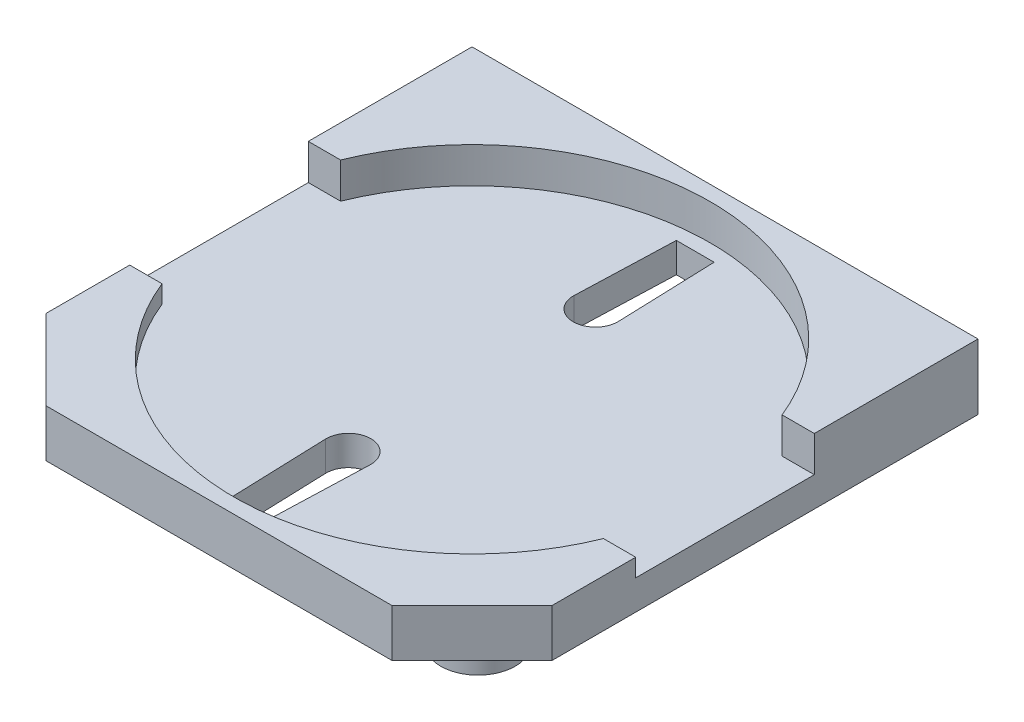
ISO-10303-21;
HEADER;
FILE_DESCRIPTION(('STEP AP214'),'2;1');
FILE_NAME('part.step','',(''),(''),'','','');
FILE_SCHEMA(('AUTOMOTIVE_DESIGN { 1 0 10303 214 1 1 1 1 }'));
ENDSEC;
DATA;
#1=APPLICATION_CONTEXT('core data for automotive mechanical design processes');
#2=APPLICATION_PROTOCOL_DEFINITION('international standard','automotive_design',2000,#1);
#3=PRODUCT_CONTEXT('',#1,'mechanical');
#4=PRODUCT('Part','Part','',(#3));
#5=PRODUCT_RELATED_PRODUCT_CATEGORY('part','',(#4));
#6=PRODUCT_DEFINITION_FORMATION('','',#4);
#7=PRODUCT_DEFINITION_CONTEXT('part definition',#1,'design');
#8=PRODUCT_DEFINITION('design','',#6,#7);
#9=PRODUCT_DEFINITION_SHAPE('','',#8);
#10=(LENGTH_UNIT() NAMED_UNIT(*) SI_UNIT(.MILLI.,.METRE.));
#11=(NAMED_UNIT(*) PLANE_ANGLE_UNIT() SI_UNIT($,.RADIAN.));
#12=(NAMED_UNIT(*) SI_UNIT($,.STERADIAN.) SOLID_ANGLE_UNIT());
#13=UNCERTAINTY_MEASURE_WITH_UNIT(LENGTH_MEASURE(1.E-05),#10,'distance_accuracy_value','');
#14=(GEOMETRIC_REPRESENTATION_CONTEXT(3) GLOBAL_UNCERTAINTY_ASSIGNED_CONTEXT((#13)) GLOBAL_UNIT_ASSIGNED_CONTEXT((#10,
#11,#12)) REPRESENTATION_CONTEXT('',''));
#15=CARTESIAN_POINT('',(0.,0.,0.));
#16=DIRECTION('',(0.,0.,1.));
#17=DIRECTION('',(1.,0.,0.));
#18=AXIS2_PLACEMENT_3D('',#15,#16,#17);
#19=CARTESIAN_POINT('',(-0.6,2.3,8.5));
#20=DIRECTION('',(0.999402445633192,0.,-0.0345651799126632));
#21=DIRECTION('',(-0.0345651799126632,0.,-0.999402445633192));
#22=AXIS2_PLACEMENT_3D('',#19,#20,#21);
#23=PLANE('',#22);
#24=DIRECTION('',(0.0345651799126632,0.,0.999402445633192));
#25=VECTOR('',#24,1.);
#26=CARTESIAN_POINT('',(-0.6,2.3,8.5));
#27=LINE('',#26,#25);
#28=CARTESIAN_POINT('',(-0.749551834224894,2.3,4.1759238849345));
#29=VERTEX_POINT('',#28);
#30=CARTESIAN_POINT('',(-0.63458584683647,2.3,7.5));
#31=VERTEX_POINT('',#30);
#32=EDGE_CURVE('E197',#29,#31,#27,.T.);
#33=ORIENTED_EDGE('',*,*,#32,.T.);
#34=DIRECTION('',(0.,-1.,0.));
#35=VECTOR('',#34,1.);
#36=CARTESIAN_POINT('',(-0.63458584683647,2.3,7.5));
#37=LINE('',#36,#35);
#38=CARTESIAN_POINT('',(-0.63458584683647,1.3,7.5));
#39=VERTEX_POINT('',#38);
#40=EDGE_CURVE('E202',#31,#39,#37,.T.);
#41=ORIENTED_EDGE('',*,*,#40,.T.);
#42=DIRECTION('',(0.0345651799126632,0.,0.999402445633192));
#43=VECTOR('',#42,1.);
#44=CARTESIAN_POINT('',(-0.6,1.3,8.5));
#45=LINE('',#44,#43);
#46=CARTESIAN_POINT('',(-0.749551834224894,1.3,4.1759238849345));
#47=VERTEX_POINT('',#46);
#48=EDGE_CURVE('E228',#47,#39,#45,.T.);
#49=ORIENTED_EDGE('',*,*,#48,.F.);
#50=DIRECTION('',(0.,-1.,0.));
#51=VECTOR('',#50,1.);
#52=CARTESIAN_POINT('',(-0.749551834224894,2.3,4.1759238849345));
#53=LINE('',#52,#51);
#54=EDGE_CURVE('E212',#29,#47,#53,.T.);
#55=ORIENTED_EDGE('',*,*,#54,.F.);
#56=EDGE_LOOP('',(#33,#41,#49,#55));
#57=FACE_BOUND('',#56,.T.);
#58=ADVANCED_FACE('F40',(#57),#23,.T.);
#59=CARTESIAN_POINT('',(0.6,2.3,8.5));
#60=DIRECTION('',(-0.999402445633192,0.,-0.0345651799126632));
#61=DIRECTION('',(-0.0345651799126632,0.,0.999402445633192));
#62=AXIS2_PLACEMENT_3D('',#59,#60,#61);
#63=PLANE('',#62);
#64=DIRECTION('',(0.0345651799126632,0.,-0.999402445633192));
#65=VECTOR('',#64,1.);
#66=CARTESIAN_POINT('',(0.6,1.3,8.5));
#67=LINE('',#66,#65);
#68=CARTESIAN_POINT('',(0.63458584683647,1.3,7.5));
#69=VERTEX_POINT('',#68);
#70=CARTESIAN_POINT('',(0.749551834224894,1.3,4.1759238849345));
#71=VERTEX_POINT('',#70);
#72=EDGE_CURVE('E215',#69,#71,#67,.T.);
#73=ORIENTED_EDGE('',*,*,#72,.F.);
#74=DIRECTION('',(0.,-1.,0.));
#75=VECTOR('',#74,1.);
#76=CARTESIAN_POINT('',(0.63458584683647,2.3,7.5));
#77=LINE('',#76,#75);
#78=CARTESIAN_POINT('',(0.63458584683647,2.3,7.5));
#79=VERTEX_POINT('',#78);
#80=EDGE_CURVE('E208',#79,#69,#77,.T.);
#81=ORIENTED_EDGE('',*,*,#80,.F.);
#82=DIRECTION('',(0.0345651799126632,0.,-0.999402445633192));
#83=VECTOR('',#82,1.);
#84=CARTESIAN_POINT('',(0.6,2.3,8.5));
#85=LINE('',#84,#83);
#86=CARTESIAN_POINT('',(0.749551834224894,2.3,4.1759238849345));
#87=VERTEX_POINT('',#86);
#88=EDGE_CURVE('E198',#79,#87,#85,.T.);
#89=ORIENTED_EDGE('',*,*,#88,.T.);
#90=DIRECTION('',(0.,-1.,0.));
#91=VECTOR('',#90,1.);
#92=CARTESIAN_POINT('',(0.749551834224894,2.3,4.1759238849345));
#93=LINE('',#92,#91);
#94=EDGE_CURVE('E234',#87,#71,#93,.T.);
#95=ORIENTED_EDGE('',*,*,#94,.T.);
#96=EDGE_LOOP('',(#73,#81,#89,#95));
#97=FACE_BOUND('',#96,.T.);
#98=ADVANCED_FACE('F510',(#97),#63,.T.);
#99=CARTESIAN_POINT('',(-8.5,3.5,8.5));
#100=DIRECTION('',(0.,0.,-1.));
#101=DIRECTION('',(-1.,0.,0.));
#102=AXIS2_PLACEMENT_3D('',#99,#100,#101);
#103=PLANE('',#102);
#104=DIRECTION('',(0.,1.,0.));
#105=VECTOR('',#104,1.);
#106=CARTESIAN_POINT('',(-5.81299423149112,0.,8.5));
#107=LINE('',#106,#105);
#108=CARTESIAN_POINT('',(-5.81299423149112,1.3,8.5));
#109=VERTEX_POINT('',#108);
#110=CARTESIAN_POINT('',(-5.81299423149112,2.9,8.5));
#111=VERTEX_POINT('',#110);
#112=EDGE_CURVE('E407',#109,#111,#107,.T.);
#113=ORIENTED_EDGE('',*,*,#112,.F.);
#114=DIRECTION('',(-1.,0.,0.));
#115=VECTOR('',#114,1.);
#116=CARTESIAN_POINT('',(-8.5,1.3,8.5));
#117=LINE('',#116,#115);
#118=CARTESIAN_POINT('',(5.81299423149112,1.3,8.5));
#119=VERTEX_POINT('',#118);
#120=EDGE_CURVE('E296',#119,#109,#117,.T.);
#121=ORIENTED_EDGE('',*,*,#120,.F.);
#122=DIRECTION('',(0.,1.,0.));
#123=VECTOR('',#122,1.);
#124=CARTESIAN_POINT('',(5.81299423149112,0.,8.5));
#125=LINE('',#124,#123);
#126=CARTESIAN_POINT('',(5.81299423149112,2.9,8.5));
#127=VERTEX_POINT('',#126);
#128=EDGE_CURVE('E404',#119,#127,#125,.T.);
#129=ORIENTED_EDGE('',*,*,#128,.T.);
#130=DIRECTION('',(1.,0.,0.));
#131=VECTOR('',#130,1.);
#132=CARTESIAN_POINT('',(5.81299423149112,2.9,8.5));
#133=LINE('',#132,#131);
#134=EDGE_CURVE('E381',#111,#127,#133,.T.);
#135=ORIENTED_EDGE('',*,*,#134,.F.);
#136=EDGE_LOOP('',(#113,#121,#129,#135));
#137=FACE_BOUND('',#136,.T.);
#138=ADVANCED_FACE('F451',(#137),#103,.F.);
#139=CARTESIAN_POINT('',(8.5,3.5,8.5));
#140=DIRECTION('',(-1.,0.,0.));
#141=DIRECTION('',(0.,0.,1.));
#142=AXIS2_PLACEMENT_3D('',#139,#140,#141);
#143=PLANE('',#142);
#144=DIRECTION('',(0.,0.,1.));
#145=VECTOR('',#144,1.);
#146=CARTESIAN_POINT('',(8.5,1.3,8.5));
#147=LINE('',#146,#145);
#148=CARTESIAN_POINT('',(8.5,1.3,-8.5));
#149=VERTEX_POINT('',#148);
#150=CARTESIAN_POINT('',(8.5,1.3,5.81299423149112));
#151=VERTEX_POINT('',#150);
#152=EDGE_CURVE('E302',#149,#151,#147,.T.);
#153=ORIENTED_EDGE('',*,*,#152,.F.);
#154=DIRECTION('',(0.,-1.,0.));
#155=VECTOR('',#154,1.);
#156=CARTESIAN_POINT('',(8.5,3.5,-8.5));
#157=LINE('',#156,#155);
#158=CARTESIAN_POINT('',(8.5,3.5,-8.5));
#159=VERTEX_POINT('',#158);
#160=EDGE_CURVE('E49',#159,#149,#157,.T.);
#161=ORIENTED_EDGE('',*,*,#160,.F.);
#162=DIRECTION('',(0.,0.,-1.));
#163=VECTOR('',#162,1.);
#164=CARTESIAN_POINT('',(8.5,3.5,8.5));
#165=LINE('',#164,#163);
#166=CARTESIAN_POINT('',(8.5,3.5,-3.));
#167=VERTEX_POINT('',#166);
#168=EDGE_CURVE('E413',#167,#159,#165,.T.);
#169=ORIENTED_EDGE('',*,*,#168,.F.);
#170=DIRECTION('',(0.,1.,0.));
#171=VECTOR('',#170,1.);
#172=CARTESIAN_POINT('',(8.5,2.9,-3.));
#173=LINE('',#172,#171);
#174=CARTESIAN_POINT('',(8.5,2.3,-3.));
#175=VERTEX_POINT('',#174);
#176=EDGE_CURVE('E393',#175,#167,#173,.T.);
#177=ORIENTED_EDGE('',*,*,#176,.F.);
#178=DIRECTION('',(0.,0.,-1.));
#179=VECTOR('',#178,1.);
#180=CARTESIAN_POINT('',(8.5,2.3,-3.));
#181=LINE('',#180,#179);
#182=CARTESIAN_POINT('',(8.5,2.3,3.));
#183=VERTEX_POINT('',#182);
#184=EDGE_CURVE('E352',#183,#175,#181,.T.);
#185=ORIENTED_EDGE('',*,*,#184,.F.);
#186=DIRECTION('',(0.,1.,0.));
#187=VECTOR('',#186,1.);
#188=CARTESIAN_POINT('',(8.5,2.3,3.));
#189=LINE('',#188,#187);
#190=CARTESIAN_POINT('',(8.5,2.9,3.));
#191=VERTEX_POINT('',#190);
#192=EDGE_CURVE('E365',#183,#191,#189,.T.);
#193=ORIENTED_EDGE('',*,*,#192,.T.);
#194=DIRECTION('',(0.,0.,-1.));
#195=VECTOR('',#194,1.);
#196=CARTESIAN_POINT('',(8.5,2.9,-3.));
#197=LINE('',#196,#195);
#198=CARTESIAN_POINT('',(8.5,2.9,5.81299423149112));
#199=VERTEX_POINT('',#198);
#200=EDGE_CURVE('E389',#199,#191,#197,.T.);
#201=ORIENTED_EDGE('',*,*,#200,.F.);
#202=DIRECTION('',(0.,1.,0.));
#203=VECTOR('',#202,1.);
#204=CARTESIAN_POINT('',(8.5,0.,5.81299423149112));
#205=LINE('',#204,#203);
#206=EDGE_CURVE('E401',#151,#199,#205,.T.);
#207=ORIENTED_EDGE('',*,*,#206,.F.);
#208=EDGE_LOOP('',(#153,#161,#169,#177,#185,#193,#201,#207));
#209=FACE_BOUND('',#208,.T.);
#210=ADVANCED_FACE('F42',(#209),#143,.F.);
#211=CARTESIAN_POINT('',(-8.5,3.5,-8.5));
#212=DIRECTION('',(0.,0.,1.));
#213=DIRECTION('',(1.,0.,0.));
#214=AXIS2_PLACEMENT_3D('',#211,#212,#213);
#215=PLANE('',#214);
#216=ORIENTED_EDGE('',*,*,#160,.T.);
#217=DIRECTION('',(1.,0.,0.));
#218=VECTOR('',#217,1.);
#219=CARTESIAN_POINT('',(-8.5,1.3,-8.5));
#220=LINE('',#219,#218);
#221=CARTESIAN_POINT('',(-8.5,1.3,-8.5));
#222=VERTEX_POINT('',#221);
#223=EDGE_CURVE('E311',#222,#149,#220,.T.);
#224=ORIENTED_EDGE('',*,*,#223,.F.);
#225=DIRECTION('',(0.,-1.,0.));
#226=VECTOR('',#225,1.);
#227=CARTESIAN_POINT('',(-8.5,3.5,-8.5));
#228=LINE('',#227,#226);
#229=CARTESIAN_POINT('',(-8.5,3.5,-8.5));
#230=VERTEX_POINT('',#229);
#231=EDGE_CURVE('E425',#230,#222,#228,.T.);
#232=ORIENTED_EDGE('',*,*,#231,.F.);
#233=DIRECTION('',(-1.,0.,0.));
#234=VECTOR('',#233,1.);
#235=CARTESIAN_POINT('',(-8.5,3.5,-8.5));
#236=LINE('',#235,#234);
#237=EDGE_CURVE('E418',#159,#230,#236,.T.);
#238=ORIENTED_EDGE('',*,*,#237,.F.);
#239=EDGE_LOOP('',(#216,#224,#232,#238));
#240=FACE_BOUND('',#239,.T.);
#241=ADVANCED_FACE('F434',(#240),#215,.F.);
#242=CARTESIAN_POINT('',(-8.5,3.5,8.5));
#243=DIRECTION('',(1.,0.,0.));
#244=DIRECTION('',(0.,0.,-1.));
#245=AXIS2_PLACEMENT_3D('',#242,#243,#244);
#246=PLANE('',#245);
#247=DIRECTION('',(0.,0.,-1.));
#248=VECTOR('',#247,1.);
#249=CARTESIAN_POINT('',(-8.5,1.3,8.5));
#250=LINE('',#249,#248);
#251=CARTESIAN_POINT('',(-8.5,1.3,5.81299423149112));
#252=VERTEX_POINT('',#251);
#253=EDGE_CURVE('E308',#252,#222,#250,.T.);
#254=ORIENTED_EDGE('',*,*,#253,.F.);
#255=DIRECTION('',(0.,1.,0.));
#256=VECTOR('',#255,1.);
#257=CARTESIAN_POINT('',(-8.5,0.,5.81299423149112));
#258=LINE('',#257,#256);
#259=CARTESIAN_POINT('',(-8.5,2.9,5.81299423149112));
#260=VERTEX_POINT('',#259);
#261=EDGE_CURVE('E410',#252,#260,#258,.T.);
#262=ORIENTED_EDGE('',*,*,#261,.T.);
#263=DIRECTION('',(0.,0.,1.));
#264=VECTOR('',#263,1.);
#265=CARTESIAN_POINT('',(-8.5,2.9,5.81299423149112));
#266=LINE('',#265,#264);
#267=CARTESIAN_POINT('',(-8.5,2.9,3.));
#268=VERTEX_POINT('',#267);
#269=EDGE_CURVE('E372',#268,#260,#266,.T.);
#270=ORIENTED_EDGE('',*,*,#269,.F.);
#271=DIRECTION('',(0.,1.,0.));
#272=VECTOR('',#271,1.);
#273=CARTESIAN_POINT('',(-8.5,2.3,3.));
#274=LINE('',#273,#272);
#275=CARTESIAN_POINT('',(-8.5,2.3,3.));
#276=VERTEX_POINT('',#275);
#277=EDGE_CURVE('E361',#276,#268,#274,.T.);
#278=ORIENTED_EDGE('',*,*,#277,.F.);
#279=DIRECTION('',(0.,0.,1.));
#280=VECTOR('',#279,1.);
#281=CARTESIAN_POINT('',(-8.5,2.3,-3.));
#282=LINE('',#281,#280);
#283=CARTESIAN_POINT('',(-8.5,2.3,-3.));
#284=VERTEX_POINT('',#283);
#285=EDGE_CURVE('E342',#284,#276,#282,.T.);
#286=ORIENTED_EDGE('',*,*,#285,.F.);
#287=DIRECTION('',(0.,1.,0.));
#288=VECTOR('',#287,1.);
#289=CARTESIAN_POINT('',(-8.5,2.9,-3.));
#290=LINE('',#289,#288);
#291=CARTESIAN_POINT('',(-8.5,3.5,-3.));
#292=VERTEX_POINT('',#291);
#293=EDGE_CURVE('E397',#284,#292,#290,.T.);
#294=ORIENTED_EDGE('',*,*,#293,.T.);
#295=DIRECTION('',(0.,0.,1.));
#296=VECTOR('',#295,1.);
#297=CARTESIAN_POINT('',(-8.5,3.5,8.5));
#298=LINE('',#297,#296);
#299=EDGE_CURVE('E421',#230,#292,#298,.T.);
#300=ORIENTED_EDGE('',*,*,#299,.F.);
#301=ORIENTED_EDGE('',*,*,#231,.T.);
#302=EDGE_LOOP('',(#254,#262,#270,#278,#286,#294,#300,#301));
#303=FACE_BOUND('',#302,.T.);
#304=ADVANCED_FACE('F464',(#303),#246,.F.);
#305=CARTESIAN_POINT('',(-8.5,0.,5.81299423149112));
#306=DIRECTION('',(0.707106781186548,0.,-0.707106781186548));
#307=DIRECTION('',(-0.707106781186548,0.,-0.707106781186548));
#308=AXIS2_PLACEMENT_3D('',#305,#306,#307);
#309=PLANE('',#308);
#310=DIRECTION('',(-0.707106781186548,0.,-0.707106781186548));
#311=VECTOR('',#310,1.);
#312=CARTESIAN_POINT('',(-8.5,1.3,5.81299423149112));
#313=LINE('',#312,#311);
#314=EDGE_CURVE('E305',#109,#252,#313,.T.);
#315=ORIENTED_EDGE('',*,*,#314,.F.);
#316=ORIENTED_EDGE('',*,*,#112,.T.);
#317=DIRECTION('',(0.707106781186547,0.,0.707106781186547));
#318=VECTOR('',#317,1.);
#319=CARTESIAN_POINT('',(-5.81299423149112,2.9,8.5));
#320=LINE('',#319,#318);
#321=EDGE_CURVE('E376',#260,#111,#320,.T.);
#322=ORIENTED_EDGE('',*,*,#321,.F.);
#323=ORIENTED_EDGE('',*,*,#261,.F.);
#324=EDGE_LOOP('',(#315,#316,#322,#323));
#325=FACE_BOUND('',#324,.T.);
#326=ADVANCED_FACE('F461',(#325),#309,.F.);
#327=CARTESIAN_POINT('',(8.5,0.,5.81299423149112));
#328=DIRECTION('',(0.707106781186548,0.,0.707106781186548));
#329=DIRECTION('',(0.707106781186548,0.,-0.707106781186548));
#330=AXIS2_PLACEMENT_3D('',#327,#328,#329);
#331=PLANE('',#330);
#332=ORIENTED_EDGE('',*,*,#128,.F.);
#333=DIRECTION('',(0.707106781186548,0.,-0.707106781186548));
#334=VECTOR('',#333,1.);
#335=CARTESIAN_POINT('',(8.5,1.3,5.81299423149112));
#336=LINE('',#335,#334);
#337=EDGE_CURVE('E12',#119,#151,#336,.T.);
#338=ORIENTED_EDGE('',*,*,#337,.T.);
#339=ORIENTED_EDGE('',*,*,#206,.T.);
#340=DIRECTION('',(0.707106781186547,0.,-0.707106781186547));
#341=VECTOR('',#340,1.);
#342=CARTESIAN_POINT('',(8.5,2.9,5.81299423149112));
#343=LINE('',#342,#341);
#344=EDGE_CURVE('E385',#127,#199,#343,.T.);
#345=ORIENTED_EDGE('',*,*,#344,.F.);
#346=EDGE_LOOP('',(#332,#338,#339,#345));
#347=FACE_BOUND('',#346,.T.);
#348=ADVANCED_FACE('F446',(#347),#331,.T.);
#349=CARTESIAN_POINT('',(-8.5,2.9,-3.));
#350=DIRECTION('',(0.,0.,-1.));
#351=DIRECTION('',(-1.,0.,0.));
#352=AXIS2_PLACEMENT_3D('',#349,#350,#351);
#353=PLANE('',#352);
#354=DIRECTION('',(-1.,0.,0.));
#355=VECTOR('',#354,1.);
#356=CARTESIAN_POINT('',(-8.5,2.3,-3.));
#357=LINE('',#356,#355);
#358=CARTESIAN_POINT('',(-7.41619848709566,2.3,-3.));
#359=VERTEX_POINT('',#358);
#360=EDGE_CURVE('E356',#359,#284,#357,.T.);
#361=ORIENTED_EDGE('',*,*,#360,.F.);
#362=DIRECTION('',(0.,1.,0.));
#363=VECTOR('',#362,1.);
#364=CARTESIAN_POINT('',(-7.41619848709566,2.3,-3.));
#365=LINE('',#364,#363);
#366=CARTESIAN_POINT('',(-7.41619848709566,3.5,-3.));
#367=VERTEX_POINT('',#366);
#368=EDGE_CURVE('E337',#359,#367,#365,.T.);
#369=ORIENTED_EDGE('',*,*,#368,.T.);
#370=DIRECTION('',(-1.,0.,0.));
#371=VECTOR('',#370,1.);
#372=CARTESIAN_POINT('',(-8.5,3.5,-3.));
#373=LINE('',#372,#371);
#374=EDGE_CURVE('E369',#367,#292,#373,.T.);
#375=ORIENTED_EDGE('',*,*,#374,.T.);
#376=ORIENTED_EDGE('',*,*,#293,.F.);
#377=EDGE_LOOP('',(#361,#369,#375,#376));
#378=FACE_BOUND('',#377,.T.);
#379=ADVANCED_FACE('F491',(#378),#353,.F.);
#380=CARTESIAN_POINT('',(-8.5,2.3,3.));
#381=DIRECTION('',(0.,0.,1.));
#382=DIRECTION('',(1.,0.,0.));
#383=AXIS2_PLACEMENT_3D('',#380,#381,#382);
#384=PLANE('',#383);
#385=DIRECTION('',(1.,0.,0.));
#386=VECTOR('',#385,1.);
#387=CARTESIAN_POINT('',(-8.5,2.3,3.));
#388=LINE('',#387,#386);
#389=CARTESIAN_POINT('',(7.41619848709566,2.3,3.));
#390=VERTEX_POINT('',#389);
#391=EDGE_CURVE('E346',#390,#183,#388,.T.);
#392=ORIENTED_EDGE('',*,*,#391,.F.);
#393=DIRECTION('',(0.,1.,0.));
#394=VECTOR('',#393,1.);
#395=CARTESIAN_POINT('',(7.41619848709566,2.3,3.));
#396=LINE('',#395,#394);
#397=CARTESIAN_POINT('',(7.41619848709566,2.9,3.));
#398=VERTEX_POINT('',#397);
#399=EDGE_CURVE('E329',#390,#398,#396,.T.);
#400=ORIENTED_EDGE('',*,*,#399,.T.);
#401=DIRECTION('',(1.,0.,0.));
#402=VECTOR('',#401,1.);
#403=CARTESIAN_POINT('',(-8.5,2.9,3.));
#404=LINE('',#403,#402);
#405=EDGE_CURVE('E341',#398,#191,#404,.T.);
#406=ORIENTED_EDGE('',*,*,#405,.T.);
#407=ORIENTED_EDGE('',*,*,#192,.F.);
#408=EDGE_LOOP('',(#392,#400,#406,#407));
#409=FACE_BOUND('',#408,.T.);
#410=ADVANCED_FACE('F483',(#409),#384,.F.);
#411=CARTESIAN_POINT('',(0.,3.5,0.));
#412=DIRECTION('',(0.,-1.,0.));
#413=DIRECTION('',(0.,0.,-1.));
#414=AXIS2_PLACEMENT_3D('',#411,#412,#413);
#415=PLANE('',#414);
#416=ORIENTED_EDGE('',*,*,#374,.F.);
#417=CARTESIAN_POINT('',(0.,3.5,0.));
#418=DIRECTION('',(0.,1.,0.));
#419=DIRECTION('',(0.,0.,1.));
#420=AXIS2_PLACEMENT_3D('',#417,#418,#419);
#421=CIRCLE('',#420,8.);
#422=CARTESIAN_POINT('',(7.41619848709566,3.5,-3.));
#423=VERTEX_POINT('',#422);
#424=EDGE_CURVE('E314',#423,#367,#421,.T.);
#425=ORIENTED_EDGE('',*,*,#424,.F.);
#426=EDGE_CURVE('E377',#167,#423,#373,.T.);
#427=ORIENTED_EDGE('',*,*,#426,.F.);
#428=ORIENTED_EDGE('',*,*,#168,.T.);
#429=ORIENTED_EDGE('',*,*,#237,.T.);
#430=ORIENTED_EDGE('',*,*,#299,.T.);
#431=EDGE_LOOP('',(#416,#425,#427,#428,#429,#430));
#432=FACE_BOUND('',#431,.T.);
#433=ADVANCED_FACE('F470',(#432),#415,.F.);
#434=ORIENTED_EDGE('',*,*,#426,.T.);
#435=DIRECTION('',(0.,1.,0.));
#436=VECTOR('',#435,1.);
#437=CARTESIAN_POINT('',(7.41619848709566,2.3,-3.));
#438=LINE('',#437,#436);
#439=CARTESIAN_POINT('',(7.41619848709566,2.3,-3.));
#440=VERTEX_POINT('',#439);
#441=EDGE_CURVE('E333',#423,#440,#438,.F.);
#442=ORIENTED_EDGE('',*,*,#441,.T.);
#443=EDGE_CURVE('E357',#175,#440,#357,.T.);
#444=ORIENTED_EDGE('',*,*,#443,.F.);
#445=ORIENTED_EDGE('',*,*,#176,.T.);
#446=EDGE_LOOP('',(#434,#442,#444,#445));
#447=FACE_BOUND('',#446,.T.);
#448=ADVANCED_FACE('F474',(#447),#353,.F.);
#449=CARTESIAN_POINT('',(0.,2.9,0.));
#450=DIRECTION('',(0.,-1.,0.));
#451=DIRECTION('',(0.,0.,-1.));
#452=AXIS2_PLACEMENT_3D('',#449,#450,#451);
#453=PLANE('',#452);
#454=ORIENTED_EDGE('',*,*,#405,.F.);
#455=CARTESIAN_POINT('',(0.,2.9,0.));
#456=DIRECTION('',(0.,-1.,0.));
#457=DIRECTION('',(0.,0.,-1.));
#458=AXIS2_PLACEMENT_3D('',#455,#456,#457);
#459=CIRCLE('',#458,8.);
#460=CARTESIAN_POINT('',(-7.41619848709566,2.9,3.));
#461=VERTEX_POINT('',#460);
#462=EDGE_CURVE('E325',#398,#461,#459,.T.);
#463=ORIENTED_EDGE('',*,*,#462,.T.);
#464=EDGE_CURVE('E347',#268,#461,#404,.T.);
#465=ORIENTED_EDGE('',*,*,#464,.F.);
#466=ORIENTED_EDGE('',*,*,#269,.T.);
#467=ORIENTED_EDGE('',*,*,#321,.T.);
#468=ORIENTED_EDGE('',*,*,#134,.T.);
#469=ORIENTED_EDGE('',*,*,#344,.T.);
#470=ORIENTED_EDGE('',*,*,#200,.T.);
#471=EDGE_LOOP('',(#454,#463,#465,#466,#467,#468,#469,#470));
#472=FACE_BOUND('',#471,.T.);
#473=ADVANCED_FACE('F454',(#472),#453,.F.);
#474=ORIENTED_EDGE('',*,*,#464,.T.);
#475=DIRECTION('',(0.,1.,0.));
#476=VECTOR('',#475,1.);
#477=CARTESIAN_POINT('',(-7.41619848709566,2.3,3.));
#478=LINE('',#477,#476);
#479=CARTESIAN_POINT('',(-7.41619848709566,2.3,3.));
#480=VERTEX_POINT('',#479);
#481=EDGE_CURVE('E321',#461,#480,#478,.F.);
#482=ORIENTED_EDGE('',*,*,#481,.T.);
#483=EDGE_CURVE('E348',#276,#480,#388,.T.);
#484=ORIENTED_EDGE('',*,*,#483,.F.);
#485=ORIENTED_EDGE('',*,*,#277,.T.);
#486=EDGE_LOOP('',(#474,#482,#484,#485));
#487=FACE_BOUND('',#486,.T.);
#488=ADVANCED_FACE('F496',(#487),#384,.F.);
#489=CARTESIAN_POINT('',(0.,2.3,0.));
#490=DIRECTION('',(0.,1.,0.));
#491=DIRECTION('',(0.,0.,1.));
#492=AXIS2_PLACEMENT_3D('',#489,#490,#491);
#493=PLANE('',#492);
#494=CARTESIAN_POINT('',(0.,2.3,0.));
#495=DIRECTION('',(0.,1.,0.));
#496=DIRECTION('',(0.,0.,1.));
#497=AXIS2_PLACEMENT_3D('',#494,#495,#496);
#498=CIRCLE('',#497,8.);
#499=EDGE_CURVE('E315',#480,#390,#498,.T.);
#500=ORIENTED_EDGE('',*,*,#499,.T.);
#501=ORIENTED_EDGE('',*,*,#391,.T.);
#502=ORIENTED_EDGE('',*,*,#184,.T.);
#503=ORIENTED_EDGE('',*,*,#443,.T.);
#504=EDGE_CURVE('E318',#440,#359,#498,.T.);
#505=ORIENTED_EDGE('',*,*,#504,.T.);
#506=ORIENTED_EDGE('',*,*,#360,.T.);
#507=ORIENTED_EDGE('',*,*,#285,.T.);
#508=ORIENTED_EDGE('',*,*,#483,.T.);
#509=EDGE_LOOP('',(#500,#501,#502,#503,#505,#506,#507,#508));
#510=FACE_BOUND('',#509,.T.);
#511=DIRECTION('',(-1.,0.,0.));
#512=VECTOR('',#511,1.);
#513=CARTESIAN_POINT('',(0.63458584683647,2.3,7.5));
#514=LINE('',#513,#512);
#515=EDGE_CURVE('E191',#79,#31,#514,.T.);
#516=ORIENTED_EDGE('',*,*,#515,.T.);
#517=ORIENTED_EDGE('',*,*,#32,.F.);
#518=CARTESIAN_POINT('',(0.,2.3,4.15));
#519=DIRECTION('',(0.,1.,0.));
#520=DIRECTION('',(0.,0.,1.));
#521=AXIS2_PLACEMENT_3D('',#518,#519,#520);
#522=CIRCLE('',#521,0.75);
#523=EDGE_CURVE('E214',#87,#29,#522,.T.);
#524=ORIENTED_EDGE('',*,*,#523,.F.);
#525=ORIENTED_EDGE('',*,*,#88,.F.);
#526=EDGE_LOOP('',(#516,#517,#524,#525));
#527=FACE_BOUND('',#526,.T.);
#528=DIRECTION('',(0.0345651799126632,0.,-0.999402445633192));
#529=VECTOR('',#528,1.);
#530=CARTESIAN_POINT('',(-0.6,2.3,-8.5));
#531=LINE('',#530,#529);
#532=CARTESIAN_POINT('',(-0.749551834224894,2.3,-4.1759238849345));
#533=VERTEX_POINT('',#532);
#534=CARTESIAN_POINT('',(-0.63458584683647,2.3,-7.5));
#535=VERTEX_POINT('',#534);
#536=EDGE_CURVE('E241',#533,#535,#531,.T.);
#537=ORIENTED_EDGE('',*,*,#536,.T.);
#538=DIRECTION('',(-1.,0.,0.));
#539=VECTOR('',#538,1.);
#540=CARTESIAN_POINT('',(0.63458584683647,2.3,-7.5));
#541=LINE('',#540,#539);
#542=CARTESIAN_POINT('',(0.63458584683647,2.3,-7.5));
#543=VERTEX_POINT('',#542);
#544=EDGE_CURVE('E818',#543,#535,#541,.T.);
#545=ORIENTED_EDGE('',*,*,#544,.F.);
#546=DIRECTION('',(0.0345651799126632,0.,0.999402445633192));
#547=VECTOR('',#546,1.);
#548=CARTESIAN_POINT('',(0.6,2.3,-8.5));
#549=LINE('',#548,#547);
#550=CARTESIAN_POINT('',(0.749551834224894,2.3,-4.1759238849345));
#551=VERTEX_POINT('',#550);
#552=EDGE_CURVE('E244',#543,#551,#549,.T.);
#553=ORIENTED_EDGE('',*,*,#552,.T.);
#554=CARTESIAN_POINT('',(0.,2.3,-4.15));
#555=DIRECTION('',(0.,-1.,0.));
#556=DIRECTION('',(0.,0.,-1.));
#557=AXIS2_PLACEMENT_3D('',#554,#555,#556);
#558=CIRCLE('',#557,0.75);
#559=EDGE_CURVE('E248',#551,#533,#558,.T.);
#560=ORIENTED_EDGE('',*,*,#559,.T.);
#561=EDGE_LOOP('',(#537,#545,#553,#560));
#562=FACE_BOUND('',#561,.T.);
#563=ADVANCED_FACE('F193',(#510,#527,#562),#493,.T.);
#564=CARTESIAN_POINT('',(0.,2.3,0.));
#565=DIRECTION('',(0.,1.,0.));
#566=DIRECTION('',(0.,0.,1.));
#567=AXIS2_PLACEMENT_3D('',#564,#565,#566);
#568=CYLINDRICAL_SURFACE('',#567,8.);
#569=ORIENTED_EDGE('',*,*,#499,.F.);
#570=ORIENTED_EDGE('',*,*,#481,.F.);
#571=ORIENTED_EDGE('',*,*,#462,.F.);
#572=ORIENTED_EDGE('',*,*,#399,.F.);
#573=EDGE_LOOP('',(#569,#570,#571,#572));
#574=FACE_BOUND('',#573,.T.);
#575=ADVANCED_FACE('F498',(#574),#568,.F.);
#576=ORIENTED_EDGE('',*,*,#504,.F.);
#577=ORIENTED_EDGE('',*,*,#441,.F.);
#578=ORIENTED_EDGE('',*,*,#424,.T.);
#579=ORIENTED_EDGE('',*,*,#368,.F.);
#580=EDGE_LOOP('',(#576,#577,#578,#579));
#581=FACE_BOUND('',#580,.T.);
#582=ADVANCED_FACE('F489',(#581),#568,.F.);
#583=CARTESIAN_POINT('',(0.,1.3,0.));
#584=DIRECTION('',(0.,-1.,0.));
#585=DIRECTION('',(0.,0.,-1.));
#586=AXIS2_PLACEMENT_3D('',#583,#584,#585);
#587=PLANE('',#586);
#588=ORIENTED_EDGE('',*,*,#120,.T.);
#589=ORIENTED_EDGE('',*,*,#314,.T.);
#590=ORIENTED_EDGE('',*,*,#253,.T.);
#591=ORIENTED_EDGE('',*,*,#223,.T.);
#592=ORIENTED_EDGE('',*,*,#152,.T.);
#593=ORIENTED_EDGE('',*,*,#337,.F.);
#594=EDGE_LOOP('',(#588,#589,#590,#591,#592,#593));
#595=FACE_BOUND('',#594,.T.);
#596=ORIENTED_EDGE('',*,*,#48,.T.);
#597=DIRECTION('',(-1.,0.,0.));
#598=VECTOR('',#597,1.);
#599=CARTESIAN_POINT('',(0.63458584683647,1.3,7.5));
#600=LINE('',#599,#598);
#601=EDGE_CURVE('E56',#69,#39,#600,.T.);
#602=ORIENTED_EDGE('',*,*,#601,.F.);
#603=ORIENTED_EDGE('',*,*,#72,.T.);
#604=CARTESIAN_POINT('',(0.,1.3,4.15));
#605=DIRECTION('',(0.,1.,0.));
#606=DIRECTION('',(0.,0.,1.));
#607=AXIS2_PLACEMENT_3D('',#604,#605,#606);
#608=CIRCLE('',#607,0.75);
#609=EDGE_CURVE('E220',#71,#47,#608,.T.);
#610=ORIENTED_EDGE('',*,*,#609,.T.);
#611=EDGE_LOOP('',(#596,#602,#603,#610));
#612=FACE_BOUND('',#611,.T.);
#613=DIRECTION('',(-1.,0.,0.));
#614=VECTOR('',#613,1.);
#615=CARTESIAN_POINT('',(0.63458584683647,1.3,-7.5));
#616=LINE('',#615,#614);
#617=CARTESIAN_POINT('',(0.63458584683647,1.3,-7.5));
#618=VERTEX_POINT('',#617);
#619=CARTESIAN_POINT('',(-0.63458584683647,1.3,-7.5));
#620=VERTEX_POINT('',#619);
#621=EDGE_CURVE('E814',#618,#620,#616,.T.);
#622=ORIENTED_EDGE('',*,*,#621,.T.);
#623=DIRECTION('',(0.0345651799126632,0.,-0.999402445633192));
#624=VECTOR('',#623,1.);
#625=CARTESIAN_POINT('',(-0.6,1.3,-8.5));
#626=LINE('',#625,#624);
#627=CARTESIAN_POINT('',(-0.749551834224894,1.3,-4.1759238849345));
#628=VERTEX_POINT('',#627);
#629=EDGE_CURVE('E238',#628,#620,#626,.T.);
#630=ORIENTED_EDGE('',*,*,#629,.F.);
#631=CARTESIAN_POINT('',(0.,1.3,-4.15));
#632=DIRECTION('',(0.,-1.,0.));
#633=DIRECTION('',(0.,0.,-1.));
#634=AXIS2_PLACEMENT_3D('',#631,#632,#633);
#635=CIRCLE('',#634,0.75);
#636=CARTESIAN_POINT('',(0.749551834224894,1.3,-4.1759238849345));
#637=VERTEX_POINT('',#636);
#638=EDGE_CURVE('E245',#637,#628,#635,.T.);
#639=ORIENTED_EDGE('',*,*,#638,.F.);
#640=DIRECTION('',(0.0345651799126632,0.,0.999402445633192));
#641=VECTOR('',#640,1.);
#642=CARTESIAN_POINT('',(0.6,1.3,-8.5));
#643=LINE('',#642,#641);
#644=EDGE_CURVE('E255',#618,#637,#643,.T.);
#645=ORIENTED_EDGE('',*,*,#644,.F.);
#646=EDGE_LOOP('',(#622,#630,#639,#645));
#647=FACE_BOUND('',#646,.T.);
#648=CARTESIAN_POINT('',(-5.5,1.3,-6.20094746980726));
#649=DIRECTION('',(0.,-1.,0.));
#650=DIRECTION('',(0.,0.,-1.));
#651=AXIS2_PLACEMENT_3D('',#648,#649,#650);
#652=CIRCLE('',#651,1.25);
#653=CARTESIAN_POINT('',(-5.5,1.3,-7.45094746980726));
#654=VERTEX_POINT('',#653);
#655=EDGE_CURVE('E292',#654,#654,#652,.T.);
#656=ORIENTED_EDGE('',*,*,#655,.F.);
#657=EDGE_LOOP('',(#656));
#658=FACE_BOUND('',#657,.T.);
#659=CARTESIAN_POINT('',(-5.5,1.3,5.29905253019274));
#660=DIRECTION('',(0.,-1.,0.));
#661=DIRECTION('',(0.,0.,-1.));
#662=AXIS2_PLACEMENT_3D('',#659,#660,#661);
#663=CIRCLE('',#662,1.25);
#664=CARTESIAN_POINT('',(-5.5,1.3,4.04905253019274));
#665=VERTEX_POINT('',#664);
#666=EDGE_CURVE('E284',#665,#665,#663,.T.);
#667=ORIENTED_EDGE('',*,*,#666,.F.);
#668=EDGE_LOOP('',(#667));
#669=FACE_BOUND('',#668,.T.);
#670=CARTESIAN_POINT('',(5.5,1.3,5.29905253019274));
#671=DIRECTION('',(0.,-1.,0.));
#672=DIRECTION('',(0.,0.,1.));
#673=AXIS2_PLACEMENT_3D('',#670,#671,#672);
#674=CIRCLE('',#673,1.25);
#675=CARTESIAN_POINT('',(5.5,1.3,6.54905253019274));
#676=VERTEX_POINT('',#675);
#677=EDGE_CURVE('E276',#676,#676,#674,.T.);
#678=ORIENTED_EDGE('',*,*,#677,.F.);
#679=EDGE_LOOP('',(#678));
#680=FACE_BOUND('',#679,.T.);
#681=CARTESIAN_POINT('',(5.5,1.3,-6.20094746980726));
#682=DIRECTION('',(0.,-1.,0.));
#683=DIRECTION('',(0.,0.,1.));
#684=AXIS2_PLACEMENT_3D('',#681,#682,#683);
#685=CIRCLE('',#684,1.25);
#686=CARTESIAN_POINT('',(5.5,1.3,-4.95094746980726));
#687=VERTEX_POINT('',#686);
#688=EDGE_CURVE('E268',#687,#687,#685,.T.);
#689=ORIENTED_EDGE('',*,*,#688,.F.);
#690=EDGE_LOOP('',(#689));
#691=FACE_BOUND('',#690,.T.);
#692=ADVANCED_FACE('F442',(#595,#612,#647,#658,#669,#680,#691),#587,.T.);
#693=CARTESIAN_POINT('',(-5.5,1.3,-6.20094746980726));
#694=DIRECTION('',(0.,-1.,0.));
#695=DIRECTION('',(0.,0.,-1.));
#696=AXIS2_PLACEMENT_3D('',#693,#694,#695);
#697=CYLINDRICAL_SURFACE('',#696,1.25);
#698=ORIENTED_EDGE('',*,*,#655,.T.);
#699=EDGE_LOOP('',(#698));
#700=FACE_BOUND('',#699,.T.);
#701=CARTESIAN_POINT('',(-5.5,0.,-6.20094746980726));
#702=DIRECTION('',(0.,-1.,0.));
#703=DIRECTION('',(0.,0.,-1.));
#704=AXIS2_PLACEMENT_3D('',#701,#702,#703);
#705=CIRCLE('',#704,1.25);
#706=CARTESIAN_POINT('',(-5.5,0.,-7.45094746980726));
#707=VERTEX_POINT('',#706);
#708=EDGE_CURVE('E288',#707,#707,#705,.T.);
#709=ORIENTED_EDGE('',*,*,#708,.F.);
#710=EDGE_LOOP('',(#709));
#711=FACE_BOUND('',#710,.T.);
#712=ADVANCED_FACE('F545',(#700,#711),#697,.T.);
#713=CARTESIAN_POINT('',(-5.5,1.3,5.29905253019274));
#714=DIRECTION('',(0.,-1.,0.));
#715=DIRECTION('',(0.,0.,-1.));
#716=AXIS2_PLACEMENT_3D('',#713,#714,#715);
#717=CYLINDRICAL_SURFACE('',#716,1.25);
#718=ORIENTED_EDGE('',*,*,#666,.T.);
#719=EDGE_LOOP('',(#718));
#720=FACE_BOUND('',#719,.T.);
#721=CARTESIAN_POINT('',(-5.5,0.,5.29905253019274));
#722=DIRECTION('',(0.,-1.,0.));
#723=DIRECTION('',(0.,0.,-1.));
#724=AXIS2_PLACEMENT_3D('',#721,#722,#723);
#725=CIRCLE('',#724,1.25);
#726=CARTESIAN_POINT('',(-5.5,0.,4.04905253019274));
#727=VERTEX_POINT('',#726);
#728=EDGE_CURVE('E280',#727,#727,#725,.T.);
#729=ORIENTED_EDGE('',*,*,#728,.F.);
#730=EDGE_LOOP('',(#729));
#731=FACE_BOUND('',#730,.T.);
#732=ADVANCED_FACE('F541',(#720,#731),#717,.T.);
#733=CARTESIAN_POINT('',(5.5,1.3,5.29905253019274));
#734=DIRECTION('',(0.,-1.,0.));
#735=DIRECTION('',(0.,0.,-1.));
#736=AXIS2_PLACEMENT_3D('',#733,#734,#735);
#737=CYLINDRICAL_SURFACE('',#736,1.25);
#738=ORIENTED_EDGE('',*,*,#677,.T.);
#739=EDGE_LOOP('',(#738));
#740=FACE_BOUND('',#739,.T.);
#741=CARTESIAN_POINT('',(5.5,0.,5.29905253019274));
#742=DIRECTION('',(0.,-1.,0.));
#743=DIRECTION('',(0.,0.,1.));
#744=AXIS2_PLACEMENT_3D('',#741,#742,#743);
#745=CIRCLE('',#744,1.25);
#746=CARTESIAN_POINT('',(5.5,0.,6.54905253019274));
#747=VERTEX_POINT('',#746);
#748=EDGE_CURVE('E272',#747,#747,#745,.T.);
#749=ORIENTED_EDGE('',*,*,#748,.F.);
#750=EDGE_LOOP('',(#749));
#751=FACE_BOUND('',#750,.T.);
#752=ADVANCED_FACE('F537',(#740,#751),#737,.T.);
#753=CARTESIAN_POINT('',(5.5,1.3,-6.20094746980726));
#754=DIRECTION('',(0.,-1.,0.));
#755=DIRECTION('',(0.,0.,-1.));
#756=AXIS2_PLACEMENT_3D('',#753,#754,#755);
#757=CYLINDRICAL_SURFACE('',#756,1.25);
#758=ORIENTED_EDGE('',*,*,#688,.T.);
#759=EDGE_LOOP('',(#758));
#760=FACE_BOUND('',#759,.T.);
#761=CARTESIAN_POINT('',(5.5,0.,-6.20094746980726));
#762=DIRECTION('',(0.,-1.,0.));
#763=DIRECTION('',(0.,0.,1.));
#764=AXIS2_PLACEMENT_3D('',#761,#762,#763);
#765=CIRCLE('',#764,1.25);
#766=CARTESIAN_POINT('',(5.5,0.,-4.95094746980726));
#767=VERTEX_POINT('',#766);
#768=EDGE_CURVE('E264',#767,#767,#765,.T.);
#769=ORIENTED_EDGE('',*,*,#768,.F.);
#770=EDGE_LOOP('',(#769));
#771=FACE_BOUND('',#770,.T.);
#772=ADVANCED_FACE('F533',(#760,#771),#757,.T.);
#773=CARTESIAN_POINT('',(0.,0.,0.));
#774=DIRECTION('',(0.,-1.,0.));
#775=DIRECTION('',(0.,0.,-1.));
#776=AXIS2_PLACEMENT_3D('',#773,#774,#775);
#777=PLANE('',#776);
#778=ORIENTED_EDGE('',*,*,#768,.T.);
#779=EDGE_LOOP('',(#778));
#780=FACE_BOUND('',#779,.T.);
#781=ADVANCED_FACE('F536',(#780),#777,.T.);
#782=ORIENTED_EDGE('',*,*,#748,.T.);
#783=EDGE_LOOP('',(#782));
#784=FACE_BOUND('',#783,.T.);
#785=ADVANCED_FACE('F643',(#784),#777,.T.);
#786=ORIENTED_EDGE('',*,*,#728,.T.);
#787=EDGE_LOOP('',(#786));
#788=FACE_BOUND('',#787,.T.);
#789=ADVANCED_FACE('F635',(#788),#777,.T.);
#790=ORIENTED_EDGE('',*,*,#708,.T.);
#791=EDGE_LOOP('',(#790));
#792=FACE_BOUND('',#791,.T.);
#793=ADVANCED_FACE('F532',(#792),#777,.T.);
#794=CARTESIAN_POINT('',(-0.6,2.3,-8.5));
#795=DIRECTION('',(-0.999402445633192,0.,-0.0345651799126632));
#796=DIRECTION('',(-0.0345651799126632,0.,0.999402445633192));
#797=AXIS2_PLACEMENT_3D('',#794,#795,#796);
#798=PLANE('',#797);
#799=ORIENTED_EDGE('',*,*,#629,.T.);
#800=DIRECTION('',(0.,-1.,0.));
#801=VECTOR('',#800,1.);
#802=CARTESIAN_POINT('',(-0.63458584683647,2.3,-7.5));
#803=LINE('',#802,#801);
#804=EDGE_CURVE('E64',#535,#620,#803,.T.);
#805=ORIENTED_EDGE('',*,*,#804,.F.);
#806=ORIENTED_EDGE('',*,*,#536,.F.);
#807=DIRECTION('',(0.,-1.,0.));
#808=VECTOR('',#807,1.);
#809=CARTESIAN_POINT('',(-0.749551834224894,2.3,-4.1759238849345));
#810=LINE('',#809,#808);
#811=EDGE_CURVE('E261',#533,#628,#810,.T.);
#812=ORIENTED_EDGE('',*,*,#811,.T.);
#813=EDGE_LOOP('',(#799,#805,#806,#812));
#814=FACE_BOUND('',#813,.T.);
#815=ADVANCED_FACE('F525',(#814),#798,.F.);
#816=CARTESIAN_POINT('',(0.,2.3,-4.15));
#817=DIRECTION('',(0.,-1.,0.));
#818=DIRECTION('',(0.,0.,-1.));
#819=AXIS2_PLACEMENT_3D('',#816,#817,#818);
#820=CYLINDRICAL_SURFACE('',#819,0.75);
#821=ORIENTED_EDGE('',*,*,#638,.T.);
#822=ORIENTED_EDGE('',*,*,#811,.F.);
#823=ORIENTED_EDGE('',*,*,#559,.F.);
#824=DIRECTION('',(0.,-1.,0.));
#825=VECTOR('',#824,1.);
#826=CARTESIAN_POINT('',(0.749551834224894,2.3,-4.1759238849345));
#827=LINE('',#826,#825);
#828=EDGE_CURVE('E252',#551,#637,#827,.T.);
#829=ORIENTED_EDGE('',*,*,#828,.T.);
#830=EDGE_LOOP('',(#821,#822,#823,#829));
#831=FACE_BOUND('',#830,.T.);
#832=ADVANCED_FACE('F521',(#831),#820,.F.);
#833=CARTESIAN_POINT('',(0.6,2.3,-8.5));
#834=DIRECTION('',(0.999402445633192,0.,-0.0345651799126632));
#835=DIRECTION('',(-0.0345651799126632,0.,-0.999402445633192));
#836=AXIS2_PLACEMENT_3D('',#833,#834,#835);
#837=PLANE('',#836);
#838=ORIENTED_EDGE('',*,*,#552,.F.);
#839=DIRECTION('',(0.,-1.,0.));
#840=VECTOR('',#839,1.);
#841=CARTESIAN_POINT('',(0.63458584683647,2.3,-7.5));
#842=LINE('',#841,#840);
#843=EDGE_CURVE('E223',#543,#618,#842,.T.);
#844=ORIENTED_EDGE('',*,*,#843,.T.);
#845=ORIENTED_EDGE('',*,*,#644,.T.);
#846=ORIENTED_EDGE('',*,*,#828,.F.);
#847=EDGE_LOOP('',(#838,#844,#845,#846));
#848=FACE_BOUND('',#847,.T.);
#849=ADVANCED_FACE('F524',(#848),#837,.F.);
#850=CARTESIAN_POINT('',(0.,2.3,4.15));
#851=DIRECTION('',(0.,-1.,0.));
#852=DIRECTION('',(0.,0.,-1.));
#853=AXIS2_PLACEMENT_3D('',#850,#851,#852);
#854=CYLINDRICAL_SURFACE('',#853,0.75);
#855=ORIENTED_EDGE('',*,*,#609,.F.);
#856=ORIENTED_EDGE('',*,*,#94,.F.);
#857=ORIENTED_EDGE('',*,*,#523,.T.);
#858=ORIENTED_EDGE('',*,*,#54,.T.);
#859=EDGE_LOOP('',(#855,#856,#857,#858));
#860=FACE_BOUND('',#859,.T.);
#861=ADVANCED_FACE('F520',(#860),#854,.F.);
#862=CARTESIAN_POINT('',(0.63458584683647,2.3,-7.5));
#863=DIRECTION('',(0.,0.,1.));
#864=DIRECTION('',(1.,0.,0.));
#865=AXIS2_PLACEMENT_3D('',#862,#863,#864);
#866=PLANE('',#865);
#867=ORIENTED_EDGE('',*,*,#621,.F.);
#868=ORIENTED_EDGE('',*,*,#843,.F.);
#869=ORIENTED_EDGE('',*,*,#544,.T.);
#870=ORIENTED_EDGE('',*,*,#804,.T.);
#871=EDGE_LOOP('',(#867,#868,#869,#870));
#872=FACE_BOUND('',#871,.T.);
#873=ADVANCED_FACE('F557',(#872),#866,.T.);
#874=CARTESIAN_POINT('',(0.63458584683647,2.3,7.5));
#875=DIRECTION('',(0.,0.,1.));
#876=DIRECTION('',(1.,0.,0.));
#877=AXIS2_PLACEMENT_3D('',#874,#875,#876);
#878=PLANE('',#877);
#879=ORIENTED_EDGE('',*,*,#601,.T.);
#880=ORIENTED_EDGE('',*,*,#40,.F.);
#881=ORIENTED_EDGE('',*,*,#515,.F.);
#882=ORIENTED_EDGE('',*,*,#80,.T.);
#883=EDGE_LOOP('',(#879,#880,#881,#882));
#884=FACE_BOUND('',#883,.T.);
#885=ADVANCED_FACE('F205',(#884),#878,.F.);
#886=CLOSED_SHELL('',(#58,#98,#138,#210,#241,#304,#326,#348,#379,#410,#433,#448,#473,#488,#563,
#575,#582,#692,#712,#732,#752,#772,#781,#785,#789,#793,#815,#832,#849,#861,#873,#885));
#887=MANIFOLD_SOLID_BREP('B2',#886);
#888=ADVANCED_BREP_SHAPE_REPRESENTATION('',(#18,#887),#14);
#889=SHAPE_DEFINITION_REPRESENTATION(#9,#888);
ENDSEC;
END-ISO-10303-21;
